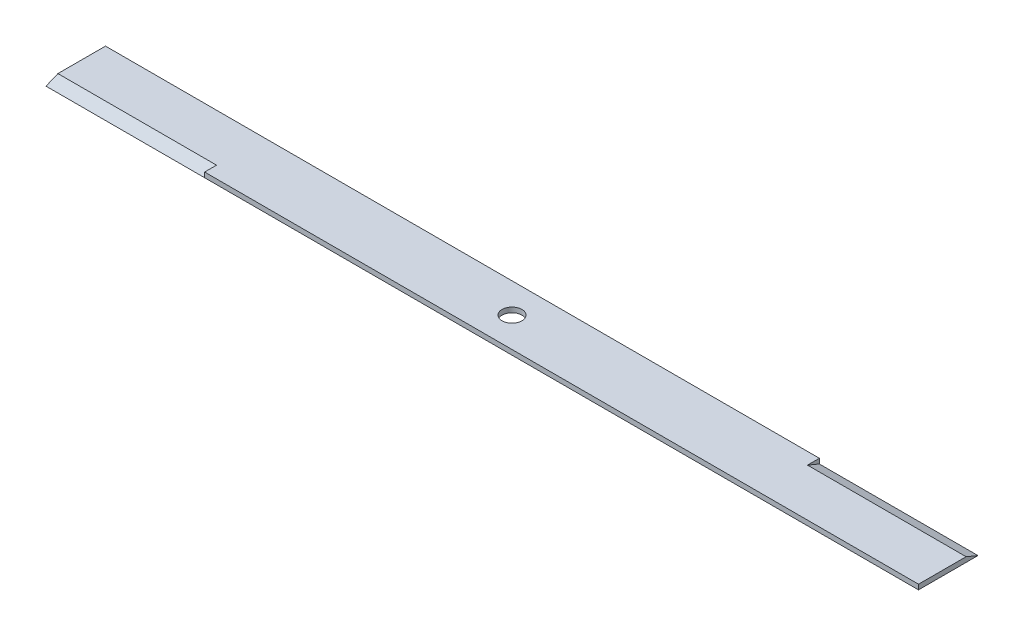
ISO-10303-21;
HEADER;
FILE_DESCRIPTION(('STEP AP214'),'2;1');
FILE_NAME('part.step','',(''),(''),'','','');
FILE_SCHEMA(('AUTOMOTIVE_DESIGN { 1 0 10303 214 1 1 1 1 }'));
ENDSEC;
DATA;
#1=APPLICATION_CONTEXT('core data for automotive mechanical design processes');
#2=APPLICATION_PROTOCOL_DEFINITION('international standard','automotive_design',2000,#1);
#3=PRODUCT_CONTEXT('',#1,'mechanical');
#4=PRODUCT('Part','Part','',(#3));
#5=PRODUCT_RELATED_PRODUCT_CATEGORY('part','',(#4));
#6=PRODUCT_DEFINITION_FORMATION('','',#4);
#7=PRODUCT_DEFINITION_CONTEXT('part definition',#1,'design');
#8=PRODUCT_DEFINITION('design','',#6,#7);
#9=PRODUCT_DEFINITION_SHAPE('','',#8);
#10=(LENGTH_UNIT() NAMED_UNIT(*) SI_UNIT(.MILLI.,.METRE.));
#11=(NAMED_UNIT(*) PLANE_ANGLE_UNIT() SI_UNIT($,.RADIAN.));
#12=(NAMED_UNIT(*) SI_UNIT($,.STERADIAN.) SOLID_ANGLE_UNIT());
#13=UNCERTAINTY_MEASURE_WITH_UNIT(LENGTH_MEASURE(1.E-05),#10,'distance_accuracy_value','');
#14=(GEOMETRIC_REPRESENTATION_CONTEXT(3) GLOBAL_UNCERTAINTY_ASSIGNED_CONTEXT((#13)) GLOBAL_UNIT_ASSIGNED_CONTEXT((#10,
#11,#12)) REPRESENTATION_CONTEXT('',''));
#15=CARTESIAN_POINT('',(0.,0.,0.));
#16=DIRECTION('',(0.,0.,1.));
#17=DIRECTION('',(1.,0.,0.));
#18=AXIS2_PLACEMENT_3D('',#15,#16,#17);
#19=CARTESIAN_POINT('',(-279.4,3.175,19.05));
#20=DIRECTION('',(0.,0.,-1.));
#21=DIRECTION('',(-1.,0.,0.));
#22=AXIS2_PLACEMENT_3D('',#19,#20,#21);
#23=PLANE('',#22);
#24=DIRECTION('',(0.,1.,0.));
#25=VECTOR('',#24,1.);
#26=CARTESIAN_POINT('',(-177.8,3.175,19.05));
#27=LINE('',#26,#25);
#28=CARTESIAN_POINT('',(-177.8,0.,19.05));
#29=VERTEX_POINT('',#28);
#30=CARTESIAN_POINT('',(-177.8,3.175,19.05));
#31=VERTEX_POINT('',#30);
#32=EDGE_CURVE('E89',#29,#31,#27,.T.);
#33=ORIENTED_EDGE('',*,*,#32,.F.);
#34=DIRECTION('',(1.,0.,0.));
#35=VECTOR('',#34,1.);
#36=CARTESIAN_POINT('',(-279.4,0.,19.05));
#37=LINE('',#36,#35);
#38=CARTESIAN_POINT('',(279.4,0.,19.05));
#39=VERTEX_POINT('',#38);
#40=EDGE_CURVE('E122',#29,#39,#37,.T.);
#41=ORIENTED_EDGE('',*,*,#40,.T.);
#42=DIRECTION('',(0.,-1.,0.));
#43=VECTOR('',#42,1.);
#44=CARTESIAN_POINT('',(279.4,3.175,19.05));
#45=LINE('',#44,#43);
#46=CARTESIAN_POINT('',(279.4,3.175,19.05));
#47=VERTEX_POINT('',#46);
#48=EDGE_CURVE('E11',#47,#39,#45,.T.);
#49=ORIENTED_EDGE('',*,*,#48,.F.);
#50=DIRECTION('',(1.,0.,0.));
#51=VECTOR('',#50,1.);
#52=CARTESIAN_POINT('',(-279.4,3.175,19.05));
#53=LINE('',#52,#51);
#54=EDGE_CURVE('E103',#31,#47,#53,.T.);
#55=ORIENTED_EDGE('',*,*,#54,.F.);
#56=EDGE_LOOP('',(#33,#41,#49,#55));
#57=FACE_BOUND('',#56,.T.);
#58=ADVANCED_FACE('F32',(#57),#23,.F.);
#59=CARTESIAN_POINT('',(-279.4,3.175,-19.05));
#60=DIRECTION('',(0.,0.,1.));
#61=DIRECTION('',(1.,0.,0.));
#62=AXIS2_PLACEMENT_3D('',#59,#60,#61);
#63=PLANE('',#62);
#64=DIRECTION('',(0.,1.,0.));
#65=VECTOR('',#64,1.);
#66=CARTESIAN_POINT('',(177.8,3.175,-19.05));
#67=LINE('',#66,#65);
#68=CARTESIAN_POINT('',(177.8,0.,-19.05));
#69=VERTEX_POINT('',#68);
#70=CARTESIAN_POINT('',(177.8,3.175,-19.05));
#71=VERTEX_POINT('',#70);
#72=EDGE_CURVE('E152',#69,#71,#67,.T.);
#73=ORIENTED_EDGE('',*,*,#72,.F.);
#74=DIRECTION('',(-1.,0.,0.));
#75=VECTOR('',#74,1.);
#76=CARTESIAN_POINT('',(-279.4,0.,-19.05));
#77=LINE('',#76,#75);
#78=CARTESIAN_POINT('',(-279.4,0.,-19.05));
#79=VERTEX_POINT('',#78);
#80=EDGE_CURVE('E129',#69,#79,#77,.T.);
#81=ORIENTED_EDGE('',*,*,#80,.T.);
#82=DIRECTION('',(0.,-1.,0.));
#83=VECTOR('',#82,1.);
#84=CARTESIAN_POINT('',(-279.4,3.175,-19.05));
#85=LINE('',#84,#83);
#86=CARTESIAN_POINT('',(-279.4,3.175,-19.05));
#87=VERTEX_POINT('',#86);
#88=EDGE_CURVE('E40',#87,#79,#85,.T.);
#89=ORIENTED_EDGE('',*,*,#88,.F.);
#90=DIRECTION('',(-1.,0.,0.));
#91=VECTOR('',#90,1.);
#92=CARTESIAN_POINT('',(-279.4,3.175,-19.05));
#93=LINE('',#92,#91);
#94=EDGE_CURVE('E112',#71,#87,#93,.T.);
#95=ORIENTED_EDGE('',*,*,#94,.F.);
#96=EDGE_LOOP('',(#73,#81,#89,#95));
#97=FACE_BOUND('',#96,.T.);
#98=ADVANCED_FACE('F182',(#97),#63,.F.);
#99=CARTESIAN_POINT('',(-279.4,3.175,19.05));
#100=DIRECTION('',(0.,1.,0.));
#101=DIRECTION('',(0.,0.,1.));
#102=AXIS2_PLACEMENT_3D('',#99,#100,#101);
#103=PLANE('',#102);
#104=DIRECTION('',(-1.,0.,0.));
#105=VECTOR('',#104,1.);
#106=CARTESIAN_POINT('',(-177.8,3.175,11.43));
#107=LINE('',#106,#105);
#108=CARTESIAN_POINT('',(-177.8,3.175,11.43));
#109=VERTEX_POINT('',#108);
#110=CARTESIAN_POINT('',(-279.4,3.175,11.43));
#111=VERTEX_POINT('',#110);
#112=EDGE_CURVE('E106',#109,#111,#107,.T.);
#113=ORIENTED_EDGE('',*,*,#112,.F.);
#114=DIRECTION('',(0.,0.,-1.));
#115=VECTOR('',#114,1.);
#116=CARTESIAN_POINT('',(-177.8,3.175,11.43));
#117=LINE('',#116,#115);
#118=EDGE_CURVE('E92',#31,#109,#117,.T.);
#119=ORIENTED_EDGE('',*,*,#118,.F.);
#120=ORIENTED_EDGE('',*,*,#54,.T.);
#121=DIRECTION('',(0.,0.,-1.));
#122=VECTOR('',#121,1.);
#123=CARTESIAN_POINT('',(279.4,3.175,-19.05));
#124=LINE('',#123,#122);
#125=CARTESIAN_POINT('',(279.4,3.175,-11.43));
#126=VERTEX_POINT('',#125);
#127=EDGE_CURVE('E109',#47,#126,#124,.T.);
#128=ORIENTED_EDGE('',*,*,#127,.T.);
#129=DIRECTION('',(1.,0.,0.));
#130=VECTOR('',#129,1.);
#131=CARTESIAN_POINT('',(177.8,3.175,-11.43));
#132=LINE('',#131,#130);
#133=CARTESIAN_POINT('',(177.8,3.175,-11.43));
#134=VERTEX_POINT('',#133);
#135=EDGE_CURVE('E157',#134,#126,#132,.T.);
#136=ORIENTED_EDGE('',*,*,#135,.F.);
#137=DIRECTION('',(0.,0.,1.));
#138=VECTOR('',#137,1.);
#139=CARTESIAN_POINT('',(177.8,3.175,-11.43));
#140=LINE('',#139,#138);
#141=EDGE_CURVE('E154',#71,#134,#140,.T.);
#142=ORIENTED_EDGE('',*,*,#141,.F.);
#143=ORIENTED_EDGE('',*,*,#94,.T.);
#144=DIRECTION('',(0.,0.,1.));
#145=VECTOR('',#144,1.);
#146=CARTESIAN_POINT('',(-279.4,3.175,-19.05));
#147=LINE('',#146,#145);
#148=EDGE_CURVE('E110',#87,#111,#147,.T.);
#149=ORIENTED_EDGE('',*,*,#148,.T.);
#150=EDGE_LOOP('',(#113,#119,#120,#128,#136,#142,#143,#149));
#151=FACE_BOUND('',#150,.T.);
#152=CARTESIAN_POINT('',(0.,3.175,0.));
#153=DIRECTION('',(0.,1.,0.));
#154=DIRECTION('',(0.,0.,1.));
#155=AXIS2_PLACEMENT_3D('',#152,#153,#154);
#156=CIRCLE('',#155,6.35);
#157=CARTESIAN_POINT('',(0.,3.175,6.35));
#158=VERTEX_POINT('',#157);
#159=EDGE_CURVE('E123',#158,#158,#156,.T.);
#160=ORIENTED_EDGE('',*,*,#159,.F.);
#161=EDGE_LOOP('',(#160));
#162=FACE_BOUND('',#161,.T.);
#163=ADVANCED_FACE('F100',(#151,#162),#103,.T.);
#164=CARTESIAN_POINT('',(-279.4,0.,19.05));
#165=DIRECTION('',(0.,1.,0.));
#166=DIRECTION('',(0.,0.,1.));
#167=AXIS2_PLACEMENT_3D('',#164,#165,#166);
#168=PLANE('',#167);
#169=DIRECTION('',(0.,0.,1.));
#170=VECTOR('',#169,1.);
#171=CARTESIAN_POINT('',(-279.4,0.,-19.05));
#172=LINE('',#171,#170);
#173=CARTESIAN_POINT('',(-279.4,0.,19.05));
#174=VERTEX_POINT('',#173);
#175=EDGE_CURVE('E119',#79,#174,#172,.T.);
#176=ORIENTED_EDGE('',*,*,#175,.F.);
#177=ORIENTED_EDGE('',*,*,#80,.F.);
#178=CARTESIAN_POINT('',(279.4,0.,-19.05));
#179=VERTEX_POINT('',#178);
#180=EDGE_CURVE('E114',#179,#69,#77,.T.);
#181=ORIENTED_EDGE('',*,*,#180,.F.);
#182=DIRECTION('',(0.,0.,-1.));
#183=VECTOR('',#182,1.);
#184=CARTESIAN_POINT('',(279.4,0.,-19.05));
#185=LINE('',#184,#183);
#186=EDGE_CURVE('E126',#39,#179,#185,.T.);
#187=ORIENTED_EDGE('',*,*,#186,.F.);
#188=ORIENTED_EDGE('',*,*,#40,.F.);
#189=EDGE_CURVE('E124',#174,#29,#37,.T.);
#190=ORIENTED_EDGE('',*,*,#189,.F.);
#191=EDGE_LOOP('',(#176,#177,#181,#187,#188,#190));
#192=FACE_BOUND('',#191,.T.);
#193=CARTESIAN_POINT('',(0.,0.,0.));
#194=DIRECTION('',(0.,1.,0.));
#195=DIRECTION('',(0.,0.,1.));
#196=AXIS2_PLACEMENT_3D('',#193,#194,#195);
#197=CIRCLE('',#196,6.35);
#198=CARTESIAN_POINT('',(0.,0.,6.35));
#199=VERTEX_POINT('',#198);
#200=EDGE_CURVE('E160',#199,#199,#197,.T.);
#201=ORIENTED_EDGE('',*,*,#200,.T.);
#202=EDGE_LOOP('',(#201));
#203=FACE_BOUND('',#202,.T.);
#204=ADVANCED_FACE('F141',(#192,#203),#168,.F.);
#205=CARTESIAN_POINT('',(-279.4,3.175,-19.05));
#206=DIRECTION('',(1.,0.,0.));
#207=DIRECTION('',(0.,0.,-1.));
#208=AXIS2_PLACEMENT_3D('',#205,#206,#207);
#209=PLANE('',#208);
#210=ORIENTED_EDGE('',*,*,#175,.T.);
#211=DIRECTION('',(0.,-0.384615384615385,0.923076923076923));
#212=VECTOR('',#211,1.);
#213=CARTESIAN_POINT('',(-279.4,0.,19.05));
#214=LINE('',#213,#212);
#215=EDGE_CURVE('E96',#111,#174,#214,.T.);
#216=ORIENTED_EDGE('',*,*,#215,.F.);
#217=ORIENTED_EDGE('',*,*,#148,.F.);
#218=ORIENTED_EDGE('',*,*,#88,.T.);
#219=EDGE_LOOP('',(#210,#216,#217,#218));
#220=FACE_BOUND('',#219,.T.);
#221=ADVANCED_FACE('F34',(#220),#209,.F.);
#222=CARTESIAN_POINT('',(279.4,3.175,-19.05));
#223=DIRECTION('',(-1.,0.,0.));
#224=DIRECTION('',(0.,0.,1.));
#225=AXIS2_PLACEMENT_3D('',#222,#223,#224);
#226=PLANE('',#225);
#227=ORIENTED_EDGE('',*,*,#186,.T.);
#228=DIRECTION('',(0.,-0.384615384615385,-0.923076923076923));
#229=VECTOR('',#228,1.);
#230=CARTESIAN_POINT('',(279.4,0.,-19.05));
#231=LINE('',#230,#229);
#232=EDGE_CURVE('E151',#126,#179,#231,.T.);
#233=ORIENTED_EDGE('',*,*,#232,.F.);
#234=ORIENTED_EDGE('',*,*,#127,.F.);
#235=ORIENTED_EDGE('',*,*,#48,.T.);
#236=EDGE_LOOP('',(#227,#233,#234,#235));
#237=FACE_BOUND('',#236,.T.);
#238=ADVANCED_FACE('F168',(#237),#226,.F.);
#239=CARTESIAN_POINT('',(0.,3.175,0.));
#240=DIRECTION('',(0.,-1.,0.));
#241=DIRECTION('',(0.,0.,-1.));
#242=AXIS2_PLACEMENT_3D('',#239,#240,#241);
#243=CYLINDRICAL_SURFACE('',#242,6.35);
#244=ORIENTED_EDGE('',*,*,#159,.T.);
#245=EDGE_LOOP('',(#244));
#246=FACE_BOUND('',#245,.T.);
#247=ORIENTED_EDGE('',*,*,#200,.F.);
#248=EDGE_LOOP('',(#247));
#249=FACE_BOUND('',#248,.T.);
#250=ADVANCED_FACE('F165',(#246,#249),#243,.F.);
#251=CARTESIAN_POINT('',(177.8,0.,-19.05));
#252=DIRECTION('',(0.,-0.923076923076923,0.384615384615385));
#253=DIRECTION('',(0.,-0.384615384615385,-0.923076923076923));
#254=AXIS2_PLACEMENT_3D('',#251,#252,#253);
#255=PLANE('',#254);
#256=ORIENTED_EDGE('',*,*,#232,.T.);
#257=ORIENTED_EDGE('',*,*,#180,.T.);
#258=DIRECTION('',(0.,-0.384615384615385,-0.923076923076923));
#259=VECTOR('',#258,1.);
#260=CARTESIAN_POINT('',(177.8,0.,-19.05));
#261=LINE('',#260,#259);
#262=EDGE_CURVE('E55',#134,#69,#261,.T.);
#263=ORIENTED_EDGE('',*,*,#262,.F.);
#264=ORIENTED_EDGE('',*,*,#135,.T.);
#265=EDGE_LOOP('',(#256,#257,#263,#264));
#266=FACE_BOUND('',#265,.T.);
#267=ADVANCED_FACE('F167',(#266),#255,.F.);
#268=CARTESIAN_POINT('',(177.8,3.175,-19.05));
#269=DIRECTION('',(1.,0.,0.));
#270=DIRECTION('',(0.,0.,-1.));
#271=AXIS2_PLACEMENT_3D('',#268,#269,#270);
#272=PLANE('',#271);
#273=ORIENTED_EDGE('',*,*,#72,.T.);
#274=ORIENTED_EDGE('',*,*,#141,.T.);
#275=ORIENTED_EDGE('',*,*,#262,.T.);
#276=EDGE_LOOP('',(#273,#274,#275));
#277=FACE_BOUND('',#276,.T.);
#278=ADVANCED_FACE('F175',(#277),#272,.T.);
#279=CARTESIAN_POINT('',(-177.8,0.,19.05));
#280=DIRECTION('',(0.,-0.923076923076923,-0.384615384615385));
#281=DIRECTION('',(0.,0.384615384615385,-0.923076923076923));
#282=AXIS2_PLACEMENT_3D('',#279,#280,#281);
#283=PLANE('',#282);
#284=ORIENTED_EDGE('',*,*,#215,.T.);
#285=ORIENTED_EDGE('',*,*,#189,.T.);
#286=DIRECTION('',(0.,-0.384615384615385,0.923076923076923));
#287=VECTOR('',#286,1.);
#288=CARTESIAN_POINT('',(-177.8,0.,19.05));
#289=LINE('',#288,#287);
#290=EDGE_CURVE('E47',#109,#29,#289,.T.);
#291=ORIENTED_EDGE('',*,*,#290,.F.);
#292=ORIENTED_EDGE('',*,*,#112,.T.);
#293=EDGE_LOOP('',(#284,#285,#291,#292));
#294=FACE_BOUND('',#293,.T.);
#295=ADVANCED_FACE('F146',(#294),#283,.F.);
#296=CARTESIAN_POINT('',(-177.8,3.175,19.05));
#297=DIRECTION('',(-1.,0.,0.));
#298=DIRECTION('',(0.,0.,1.));
#299=AXIS2_PLACEMENT_3D('',#296,#297,#298);
#300=PLANE('',#299);
#301=ORIENTED_EDGE('',*,*,#32,.T.);
#302=ORIENTED_EDGE('',*,*,#118,.T.);
#303=ORIENTED_EDGE('',*,*,#290,.T.);
#304=EDGE_LOOP('',(#301,#302,#303));
#305=FACE_BOUND('',#304,.T.);
#306=ADVANCED_FACE('F91',(#305),#300,.T.);
#307=CLOSED_SHELL('',(#58,#98,#163,#204,#221,#238,#250,#267,#278,#295,#306));
#308=MANIFOLD_SOLID_BREP('B2',#307);
#309=ADVANCED_BREP_SHAPE_REPRESENTATION('',(#18,#308),#14);
#310=SHAPE_DEFINITION_REPRESENTATION(#9,#309);
ENDSEC;
END-ISO-10303-21;
